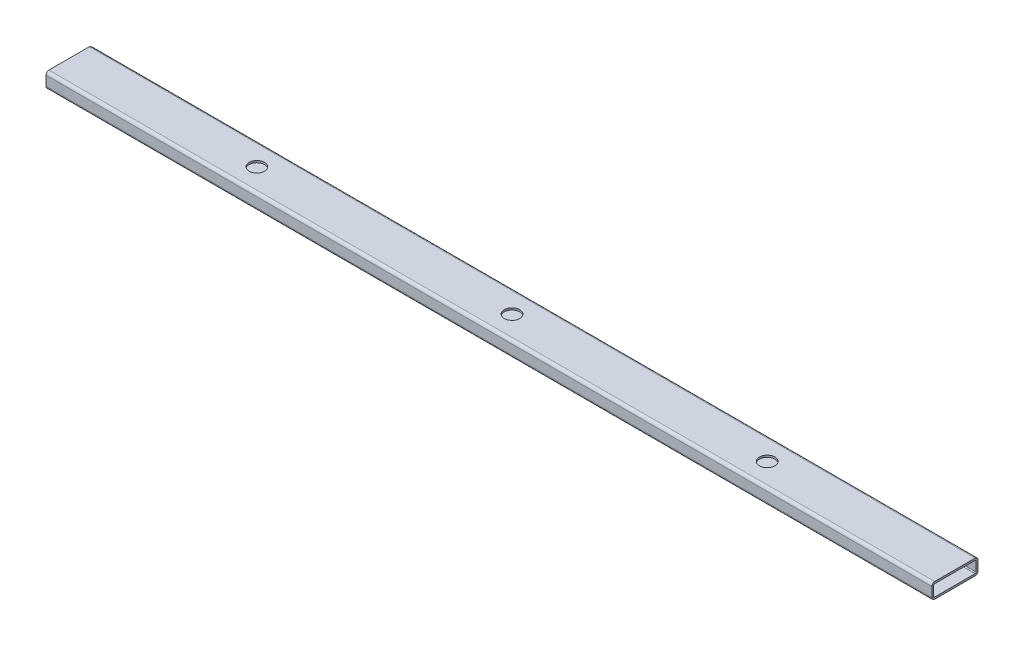
ISO-10303-21;
HEADER;
FILE_DESCRIPTION(('STEP AP214'),'2;1');
FILE_NAME('part.step','',(''),(''),'','','');
FILE_SCHEMA(('AUTOMOTIVE_DESIGN { 1 0 10303 214 1 1 1 1 }'));
ENDSEC;
DATA;
#1=APPLICATION_CONTEXT('core data for automotive mechanical design processes');
#2=APPLICATION_PROTOCOL_DEFINITION('international standard','automotive_design',2000,#1);
#3=PRODUCT_CONTEXT('',#1,'mechanical');
#4=PRODUCT('Part','Part','',(#3));
#5=PRODUCT_RELATED_PRODUCT_CATEGORY('part','',(#4));
#6=PRODUCT_DEFINITION_FORMATION('','',#4);
#7=PRODUCT_DEFINITION_CONTEXT('part definition',#1,'design');
#8=PRODUCT_DEFINITION('design','',#6,#7);
#9=PRODUCT_DEFINITION_SHAPE('','',#8);
#10=(LENGTH_UNIT() NAMED_UNIT(*) SI_UNIT(.MILLI.,.METRE.));
#11=(NAMED_UNIT(*) PLANE_ANGLE_UNIT() SI_UNIT($,.RADIAN.));
#12=(NAMED_UNIT(*) SI_UNIT($,.STERADIAN.) SOLID_ANGLE_UNIT());
#13=UNCERTAINTY_MEASURE_WITH_UNIT(LENGTH_MEASURE(1.E-05),#10,'distance_accuracy_value','');
#14=(GEOMETRIC_REPRESENTATION_CONTEXT(3) GLOBAL_UNCERTAINTY_ASSIGNED_CONTEXT((#13)) GLOBAL_UNIT_ASSIGNED_CONTEXT((#10,
#11,#12)) REPRESENTATION_CONTEXT('',''));
#15=CARTESIAN_POINT('',(0.,0.,0.));
#16=DIRECTION('',(0.,0.,1.));
#17=DIRECTION('',(1.,0.,0.));
#18=AXIS2_PLACEMENT_3D('',#15,#16,#17);
#19=CARTESIAN_POINT('',(420.6875,-0.00100000000002529,0.));
#20=DIRECTION('',(0.,1.,0.));
#21=DIRECTION('',(0.,0.,1.));
#22=AXIS2_PLACEMENT_3D('',#19,#20,#21);
#23=CYLINDRICAL_SURFACE('',#22,12.7);
#24=CARTESIAN_POINT('',(420.6875,22.225,0.));
#25=DIRECTION('',(0.,-1.,0.));
#26=DIRECTION('',(0.,0.,-1.));
#27=AXIS2_PLACEMENT_3D('',#24,#25,#26);
#28=CIRCLE('',#27,12.7);
#29=CARTESIAN_POINT('',(420.6875,22.225,-12.7));
#30=VERTEX_POINT('',#29);
#31=EDGE_CURVE('E43',#30,#30,#28,.F.);
#32=ORIENTED_EDGE('',*,*,#31,.F.);
#33=EDGE_LOOP('',(#32));
#34=FACE_BOUND('',#33,.T.);
#35=CARTESIAN_POINT('',(420.6875,25.4,0.));
#36=DIRECTION('',(0.,1.,0.));
#37=DIRECTION('',(0.,0.,1.));
#38=AXIS2_PLACEMENT_3D('',#35,#36,#37);
#39=CIRCLE('',#38,12.7);
#40=CARTESIAN_POINT('',(420.6875,25.4,12.7));
#41=VERTEX_POINT('',#40);
#42=EDGE_CURVE('E11',#41,#41,#39,.T.);
#43=ORIENTED_EDGE('',*,*,#42,.T.);
#44=EDGE_LOOP('',(#43));
#45=FACE_BOUND('',#44,.T.);
#46=ADVANCED_FACE('F36',(#34,#45),#23,.F.);
#47=CARTESIAN_POINT('',(730.25,20.6248,-33.3248));
#48=DIRECTION('',(1.,0.,0.));
#49=DIRECTION('',(0.,0.,-1.));
#50=AXIS2_PLACEMENT_3D('',#47,#48,#49);
#51=PLANE('',#50);
#52=CARTESIAN_POINT('',(730.25,20.6248,-33.3248));
#53=DIRECTION('',(1.,0.,0.));
#54=DIRECTION('',(0.,0.,-1.));
#55=AXIS2_PLACEMENT_3D('',#52,#53,#54);
#56=CIRCLE('',#55,4.77519999999999);
#57=CARTESIAN_POINT('',(730.25,20.6248,-38.1));
#58=VERTEX_POINT('',#57);
#59=CARTESIAN_POINT('',(730.25,25.4,-33.3248));
#60=VERTEX_POINT('',#59);
#61=EDGE_CURVE('E217',#58,#60,#56,.T.);
#62=ORIENTED_EDGE('',*,*,#61,.T.);
#63=DIRECTION('',(0.,0.,1.));
#64=VECTOR('',#63,1.);
#65=CARTESIAN_POINT('',(730.25,25.4,-33.3248));
#66=LINE('',#65,#64);
#67=CARTESIAN_POINT('',(730.25,25.4,33.3248));
#68=VERTEX_POINT('',#67);
#69=EDGE_CURVE('E220',#60,#68,#66,.T.);
#70=ORIENTED_EDGE('',*,*,#69,.T.);
#71=CARTESIAN_POINT('',(730.25,20.6248,33.3248));
#72=DIRECTION('',(1.,0.,0.));
#73=DIRECTION('',(0.,0.,1.));
#74=AXIS2_PLACEMENT_3D('',#71,#72,#73);
#75=CIRCLE('',#74,4.77519999999999);
#76=CARTESIAN_POINT('',(730.25,20.6248,38.1));
#77=VERTEX_POINT('',#76);
#78=EDGE_CURVE('E223',#68,#77,#75,.T.);
#79=ORIENTED_EDGE('',*,*,#78,.T.);
#80=DIRECTION('',(0.,-1.,0.));
#81=VECTOR('',#80,1.);
#82=CARTESIAN_POINT('',(730.25,20.6248,38.1));
#83=LINE('',#82,#81);
#84=CARTESIAN_POINT('',(730.25,4.77519999999999,38.1));
#85=VERTEX_POINT('',#84);
#86=EDGE_CURVE('E225',#77,#85,#83,.T.);
#87=ORIENTED_EDGE('',*,*,#86,.T.);
#88=CARTESIAN_POINT('',(730.25,4.77519999999999,33.3248));
#89=DIRECTION('',(1.,0.,0.));
#90=DIRECTION('',(0.,0.,1.));
#91=AXIS2_PLACEMENT_3D('',#88,#89,#90);
#92=CIRCLE('',#91,4.7752);
#93=CARTESIAN_POINT('',(730.25,0.,33.3248));
#94=VERTEX_POINT('',#93);
#95=EDGE_CURVE('E227',#85,#94,#92,.T.);
#96=ORIENTED_EDGE('',*,*,#95,.T.);
#97=DIRECTION('',(0.,0.,-1.));
#98=VECTOR('',#97,1.);
#99=CARTESIAN_POINT('',(730.25,0.,-33.3248));
#100=LINE('',#99,#98);
#101=CARTESIAN_POINT('',(730.25,0.,-33.3248));
#102=VERTEX_POINT('',#101);
#103=EDGE_CURVE('E229',#94,#102,#100,.T.);
#104=ORIENTED_EDGE('',*,*,#103,.T.);
#105=CARTESIAN_POINT('',(730.25,4.77520000000001,-33.3248));
#106=DIRECTION('',(1.,0.,0.));
#107=DIRECTION('',(0.,0.,1.));
#108=AXIS2_PLACEMENT_3D('',#105,#106,#107);
#109=CIRCLE('',#108,4.7752);
#110=CARTESIAN_POINT('',(730.25,4.77520000000001,-38.1));
#111=VERTEX_POINT('',#110);
#112=EDGE_CURVE('E231',#102,#111,#109,.T.);
#113=ORIENTED_EDGE('',*,*,#112,.T.);
#114=DIRECTION('',(0.,1.,0.));
#115=VECTOR('',#114,1.);
#116=CARTESIAN_POINT('',(730.25,20.6248,-38.1));
#117=LINE('',#116,#115);
#118=EDGE_CURVE('E233',#111,#58,#117,.T.);
#119=ORIENTED_EDGE('',*,*,#118,.T.);
#120=EDGE_LOOP('',(#62,#70,#79,#87,#96,#104,#113,#119));
#121=FACE_BOUND('',#120,.T.);
#122=DIRECTION('',(0.,0.,1.));
#123=VECTOR('',#122,1.);
#124=CARTESIAN_POINT('',(730.25,22.225,-33.3248));
#125=LINE('',#124,#123);
#126=CARTESIAN_POINT('',(730.25,22.225,-33.3248));
#127=VERTEX_POINT('',#126);
#128=CARTESIAN_POINT('',(730.25,22.225,33.3248));
#129=VERTEX_POINT('',#128);
#130=EDGE_CURVE('E156',#127,#129,#125,.T.);
#131=ORIENTED_EDGE('',*,*,#130,.F.);
#132=CARTESIAN_POINT('',(730.25,20.6248,-33.3248));
#133=DIRECTION('',(1.,0.,0.));
#134=DIRECTION('',(0.,0.,-1.));
#135=AXIS2_PLACEMENT_3D('',#132,#133,#134);
#136=CIRCLE('',#135,1.6002);
#137=CARTESIAN_POINT('',(730.25,20.6248,-34.925));
#138=VERTEX_POINT('',#137);
#139=EDGE_CURVE('E148',#138,#127,#136,.T.);
#140=ORIENTED_EDGE('',*,*,#139,.F.);
#141=DIRECTION('',(0.,1.,0.));
#142=VECTOR('',#141,1.);
#143=CARTESIAN_POINT('',(730.25,20.6248,-34.925));
#144=LINE('',#143,#142);
#145=CARTESIAN_POINT('',(730.25,4.77520000000001,-34.925));
#146=VERTEX_POINT('',#145);
#147=EDGE_CURVE('E184',#146,#138,#144,.T.);
#148=ORIENTED_EDGE('',*,*,#147,.F.);
#149=CARTESIAN_POINT('',(730.25,4.77520000000001,-33.3248));
#150=DIRECTION('',(1.,0.,0.));
#151=DIRECTION('',(0.,0.,1.));
#152=AXIS2_PLACEMENT_3D('',#149,#150,#151);
#153=CIRCLE('',#152,1.6002);
#154=CARTESIAN_POINT('',(730.25,3.17500000000001,-33.3248));
#155=VERTEX_POINT('',#154);
#156=EDGE_CURVE('E182',#155,#146,#153,.T.);
#157=ORIENTED_EDGE('',*,*,#156,.F.);
#158=DIRECTION('',(0.,0.,-1.));
#159=VECTOR('',#158,1.);
#160=CARTESIAN_POINT('',(730.25,3.17500000000001,-33.3248));
#161=LINE('',#160,#159);
#162=CARTESIAN_POINT('',(730.25,3.17499999999999,33.3248));
#163=VERTEX_POINT('',#162);
#164=EDGE_CURVE('E180',#163,#155,#161,.T.);
#165=ORIENTED_EDGE('',*,*,#164,.F.);
#166=CARTESIAN_POINT('',(730.25,4.77519999999999,33.3248));
#167=DIRECTION('',(1.,0.,0.));
#168=DIRECTION('',(0.,0.,1.));
#169=AXIS2_PLACEMENT_3D('',#166,#167,#168);
#170=CIRCLE('',#169,1.60020000000001);
#171=CARTESIAN_POINT('',(730.25,4.77519999999999,34.925));
#172=VERTEX_POINT('',#171);
#173=EDGE_CURVE('E178',#172,#163,#170,.T.);
#174=ORIENTED_EDGE('',*,*,#173,.F.);
#175=DIRECTION('',(0.,-1.,0.));
#176=VECTOR('',#175,1.);
#177=CARTESIAN_POINT('',(730.25,20.6248,34.925));
#178=LINE('',#177,#176);
#179=CARTESIAN_POINT('',(730.25,20.6248,34.925));
#180=VERTEX_POINT('',#179);
#181=EDGE_CURVE('E173',#180,#172,#178,.T.);
#182=ORIENTED_EDGE('',*,*,#181,.F.);
#183=CARTESIAN_POINT('',(730.25,20.6248,33.3248));
#184=DIRECTION('',(1.,0.,0.));
#185=DIRECTION('',(0.,0.,1.));
#186=AXIS2_PLACEMENT_3D('',#183,#184,#185);
#187=CIRCLE('',#186,1.60020000000001);
#188=EDGE_CURVE('E171',#129,#180,#187,.T.);
#189=ORIENTED_EDGE('',*,*,#188,.F.);
#190=EDGE_LOOP('',(#131,#140,#148,#157,#165,#174,#182,#189));
#191=FACE_BOUND('',#190,.T.);
#192=ADVANCED_FACE('F169',(#121,#191),#51,.T.);
#193=CARTESIAN_POINT('',(-730.25,20.6248,-33.3248));
#194=DIRECTION('',(1.,0.,0.));
#195=DIRECTION('',(0.,0.,-1.));
#196=AXIS2_PLACEMENT_3D('',#193,#194,#195);
#197=PLANE('',#196);
#198=CARTESIAN_POINT('',(-730.25,20.6248,-33.3248));
#199=DIRECTION('',(1.,0.,0.));
#200=DIRECTION('',(0.,0.,-1.));
#201=AXIS2_PLACEMENT_3D('',#198,#199,#200);
#202=CIRCLE('',#201,4.77519999999999);
#203=CARTESIAN_POINT('',(-730.25,20.6248,-38.1));
#204=VERTEX_POINT('',#203);
#205=CARTESIAN_POINT('',(-730.25,25.4,-33.3248));
#206=VERTEX_POINT('',#205);
#207=EDGE_CURVE('E165',#204,#206,#202,.T.);
#208=ORIENTED_EDGE('',*,*,#207,.F.);
#209=DIRECTION('',(0.,1.,0.));
#210=VECTOR('',#209,1.);
#211=CARTESIAN_POINT('',(-730.25,20.6248,-38.1));
#212=LINE('',#211,#210);
#213=CARTESIAN_POINT('',(-730.25,4.77520000000001,-38.1));
#214=VERTEX_POINT('',#213);
#215=EDGE_CURVE('E221',#214,#204,#212,.T.);
#216=ORIENTED_EDGE('',*,*,#215,.F.);
#217=CARTESIAN_POINT('',(-730.25,4.77520000000001,-33.3248));
#218=DIRECTION('',(1.,0.,0.));
#219=DIRECTION('',(0.,0.,1.));
#220=AXIS2_PLACEMENT_3D('',#217,#218,#219);
#221=CIRCLE('',#220,4.7752);
#222=CARTESIAN_POINT('',(-730.25,0.,-33.3248));
#223=VERTEX_POINT('',#222);
#224=EDGE_CURVE('E248',#223,#214,#221,.T.);
#225=ORIENTED_EDGE('',*,*,#224,.F.);
#226=DIRECTION('',(0.,0.,-1.));
#227=VECTOR('',#226,1.);
#228=CARTESIAN_POINT('',(-730.25,0.,-33.3248));
#229=LINE('',#228,#227);
#230=CARTESIAN_POINT('',(-730.25,0.,33.3248));
#231=VERTEX_POINT('',#230);
#232=EDGE_CURVE('E246',#231,#223,#229,.T.);
#233=ORIENTED_EDGE('',*,*,#232,.F.);
#234=CARTESIAN_POINT('',(-730.25,4.77519999999999,33.3248));
#235=DIRECTION('',(1.,0.,0.));
#236=DIRECTION('',(0.,0.,1.));
#237=AXIS2_PLACEMENT_3D('',#234,#235,#236);
#238=CIRCLE('',#237,4.7752);
#239=CARTESIAN_POINT('',(-730.25,4.77519999999999,38.1));
#240=VERTEX_POINT('',#239);
#241=EDGE_CURVE('E244',#240,#231,#238,.T.);
#242=ORIENTED_EDGE('',*,*,#241,.F.);
#243=DIRECTION('',(0.,-1.,0.));
#244=VECTOR('',#243,1.);
#245=CARTESIAN_POINT('',(-730.25,20.6248,38.1));
#246=LINE('',#245,#244);
#247=CARTESIAN_POINT('',(-730.25,20.6248,38.1));
#248=VERTEX_POINT('',#247);
#249=EDGE_CURVE('E242',#248,#240,#246,.T.);
#250=ORIENTED_EDGE('',*,*,#249,.F.);
#251=CARTESIAN_POINT('',(-730.25,20.6248,33.3248));
#252=DIRECTION('',(1.,0.,0.));
#253=DIRECTION('',(0.,0.,1.));
#254=AXIS2_PLACEMENT_3D('',#251,#252,#253);
#255=CIRCLE('',#254,4.77519999999999);
#256=CARTESIAN_POINT('',(-730.25,25.4,33.3248));
#257=VERTEX_POINT('',#256);
#258=EDGE_CURVE('E240',#257,#248,#255,.T.);
#259=ORIENTED_EDGE('',*,*,#258,.F.);
#260=DIRECTION('',(0.,0.,1.));
#261=VECTOR('',#260,1.);
#262=CARTESIAN_POINT('',(-730.25,25.4,-33.3248));
#263=LINE('',#262,#261);
#264=EDGE_CURVE('E238',#206,#257,#263,.T.);
#265=ORIENTED_EDGE('',*,*,#264,.F.);
#266=EDGE_LOOP('',(#208,#216,#225,#233,#242,#250,#259,#265));
#267=FACE_BOUND('',#266,.T.);
#268=CARTESIAN_POINT('',(-730.25,20.6248,-33.3248));
#269=DIRECTION('',(1.,0.,0.));
#270=DIRECTION('',(0.,0.,-1.));
#271=AXIS2_PLACEMENT_3D('',#268,#269,#270);
#272=CIRCLE('',#271,1.6002);
#273=CARTESIAN_POINT('',(-730.25,20.6248,-34.925));
#274=VERTEX_POINT('',#273);
#275=CARTESIAN_POINT('',(-730.25,22.225,-33.3248));
#276=VERTEX_POINT('',#275);
#277=EDGE_CURVE('E58',#274,#276,#272,.T.);
#278=ORIENTED_EDGE('',*,*,#277,.T.);
#279=DIRECTION('',(0.,0.,1.));
#280=VECTOR('',#279,1.);
#281=CARTESIAN_POINT('',(-730.25,22.225,-33.3248));
#282=LINE('',#281,#280);
#283=CARTESIAN_POINT('',(-730.25,22.225,33.3248));
#284=VERTEX_POINT('',#283);
#285=EDGE_CURVE('E164',#276,#284,#282,.T.);
#286=ORIENTED_EDGE('',*,*,#285,.T.);
#287=CARTESIAN_POINT('',(-730.25,20.6248,33.3248));
#288=DIRECTION('',(1.,0.,0.));
#289=DIRECTION('',(0.,0.,1.));
#290=AXIS2_PLACEMENT_3D('',#287,#288,#289);
#291=CIRCLE('',#290,1.60020000000001);
#292=CARTESIAN_POINT('',(-730.25,20.6248,34.925));
#293=VERTEX_POINT('',#292);
#294=EDGE_CURVE('E189',#284,#293,#291,.T.);
#295=ORIENTED_EDGE('',*,*,#294,.T.);
#296=DIRECTION('',(0.,-1.,0.));
#297=VECTOR('',#296,1.);
#298=CARTESIAN_POINT('',(-730.25,20.6248,34.925));
#299=LINE('',#298,#297);
#300=CARTESIAN_POINT('',(-730.25,4.77519999999999,34.925));
#301=VERTEX_POINT('',#300);
#302=EDGE_CURVE('E192',#293,#301,#299,.T.);
#303=ORIENTED_EDGE('',*,*,#302,.T.);
#304=CARTESIAN_POINT('',(-730.25,4.77519999999999,33.3248));
#305=DIRECTION('',(1.,0.,0.));
#306=DIRECTION('',(0.,0.,1.));
#307=AXIS2_PLACEMENT_3D('',#304,#305,#306);
#308=CIRCLE('',#307,1.60020000000001);
#309=CARTESIAN_POINT('',(-730.25,3.17499999999999,33.3248));
#310=VERTEX_POINT('',#309);
#311=EDGE_CURVE('E195',#301,#310,#308,.T.);
#312=ORIENTED_EDGE('',*,*,#311,.T.);
#313=DIRECTION('',(0.,0.,-1.));
#314=VECTOR('',#313,1.);
#315=CARTESIAN_POINT('',(-730.25,3.17500000000001,-33.3248));
#316=LINE('',#315,#314);
#317=CARTESIAN_POINT('',(-730.25,3.17500000000001,-33.3248));
#318=VERTEX_POINT('',#317);
#319=EDGE_CURVE('E198',#310,#318,#316,.T.);
#320=ORIENTED_EDGE('',*,*,#319,.T.);
#321=CARTESIAN_POINT('',(-730.25,4.77520000000001,-33.3248));
#322=DIRECTION('',(1.,0.,0.));
#323=DIRECTION('',(0.,0.,1.));
#324=AXIS2_PLACEMENT_3D('',#321,#322,#323);
#325=CIRCLE('',#324,1.6002);
#326=CARTESIAN_POINT('',(-730.25,4.77520000000001,-34.925));
#327=VERTEX_POINT('',#326);
#328=EDGE_CURVE('E201',#318,#327,#325,.T.);
#329=ORIENTED_EDGE('',*,*,#328,.T.);
#330=DIRECTION('',(0.,1.,0.));
#331=VECTOR('',#330,1.);
#332=CARTESIAN_POINT('',(-730.25,20.6248,-34.925));
#333=LINE('',#332,#331);
#334=EDGE_CURVE('E157',#327,#274,#333,.T.);
#335=ORIENTED_EDGE('',*,*,#334,.T.);
#336=EDGE_LOOP('',(#278,#286,#295,#303,#312,#320,#329,#335));
#337=FACE_BOUND('',#336,.T.);
#338=ADVANCED_FACE('F293',(#267,#337),#197,.F.);
#339=CARTESIAN_POINT('',(730.25,20.6248,-33.3248));
#340=DIRECTION('',(-1.,0.,0.));
#341=DIRECTION('',(0.,0.,1.));
#342=AXIS2_PLACEMENT_3D('',#339,#340,#341);
#343=CYLINDRICAL_SURFACE('',#342,4.77519999999999);
#344=ORIENTED_EDGE('',*,*,#207,.T.);
#345=DIRECTION('',(-1.,0.,0.));
#346=VECTOR('',#345,1.);
#347=CARTESIAN_POINT('',(730.25,25.4,-33.3248));
#348=LINE('',#347,#346);
#349=EDGE_CURVE('E271',#60,#206,#348,.T.);
#350=ORIENTED_EDGE('',*,*,#349,.F.);
#351=ORIENTED_EDGE('',*,*,#61,.F.);
#352=DIRECTION('',(-1.,0.,0.));
#353=VECTOR('',#352,1.);
#354=CARTESIAN_POINT('',(730.25,20.6248,-38.1));
#355=LINE('',#354,#353);
#356=EDGE_CURVE('E235',#58,#204,#355,.T.);
#357=ORIENTED_EDGE('',*,*,#356,.T.);
#358=EDGE_LOOP('',(#344,#350,#351,#357));
#359=FACE_BOUND('',#358,.T.);
#360=ADVANCED_FACE('F283',(#359),#343,.T.);
#361=CARTESIAN_POINT('',(730.25,25.4,-33.3248));
#362=DIRECTION('',(0.,-1.,0.));
#363=DIRECTION('',(0.,0.,-1.));
#364=AXIS2_PLACEMENT_3D('',#361,#362,#363);
#365=PLANE('',#364);
#366=CARTESIAN_POINT('',(0.,25.4,0.));
#367=DIRECTION('',(0.,1.,0.));
#368=DIRECTION('',(0.,0.,1.));
#369=AXIS2_PLACEMENT_3D('',#366,#367,#368);
#370=CIRCLE('',#369,12.7);
#371=CARTESIAN_POINT('',(0.,25.4,12.7));
#372=VERTEX_POINT('',#371);
#373=EDGE_CURVE('E365',#372,#372,#370,.T.);
#374=ORIENTED_EDGE('',*,*,#373,.F.);
#375=EDGE_LOOP('',(#374));
#376=FACE_BOUND('',#375,.T.);
#377=CARTESIAN_POINT('',(-420.6875,25.4,0.));
#378=DIRECTION('',(0.,1.,0.));
#379=DIRECTION('',(0.,0.,1.));
#380=AXIS2_PLACEMENT_3D('',#377,#378,#379);
#381=CIRCLE('',#380,12.7);
#382=CARTESIAN_POINT('',(-420.6875,25.4,12.7));
#383=VERTEX_POINT('',#382);
#384=EDGE_CURVE('E187',#383,#383,#381,.T.);
#385=ORIENTED_EDGE('',*,*,#384,.F.);
#386=EDGE_LOOP('',(#385));
#387=FACE_BOUND('',#386,.T.);
#388=ORIENTED_EDGE('',*,*,#264,.T.);
#389=DIRECTION('',(-1.,0.,0.));
#390=VECTOR('',#389,1.);
#391=CARTESIAN_POINT('',(730.25,25.4,33.3248));
#392=LINE('',#391,#390);
#393=EDGE_CURVE('E268',#68,#257,#392,.T.);
#394=ORIENTED_EDGE('',*,*,#393,.F.);
#395=ORIENTED_EDGE('',*,*,#69,.F.);
#396=ORIENTED_EDGE('',*,*,#349,.T.);
#397=EDGE_LOOP('',(#388,#394,#395,#396));
#398=FACE_BOUND('',#397,.T.);
#399=ORIENTED_EDGE('',*,*,#42,.F.);
#400=EDGE_LOOP('',(#399));
#401=FACE_BOUND('',#400,.T.);
#402=ADVANCED_FACE('F280',(#376,#387,#398,#401),#365,.F.);
#403=CARTESIAN_POINT('',(730.25,20.6248,33.3248));
#404=DIRECTION('',(-1.,0.,0.));
#405=DIRECTION('',(0.,0.,1.));
#406=AXIS2_PLACEMENT_3D('',#403,#404,#405);
#407=CYLINDRICAL_SURFACE('',#406,4.77519999999999);
#408=ORIENTED_EDGE('',*,*,#258,.T.);
#409=DIRECTION('',(-1.,0.,0.));
#410=VECTOR('',#409,1.);
#411=CARTESIAN_POINT('',(730.25,20.6248,38.1));
#412=LINE('',#411,#410);
#413=EDGE_CURVE('E265',#77,#248,#412,.T.);
#414=ORIENTED_EDGE('',*,*,#413,.F.);
#415=ORIENTED_EDGE('',*,*,#78,.F.);
#416=ORIENTED_EDGE('',*,*,#393,.T.);
#417=EDGE_LOOP('',(#408,#414,#415,#416));
#418=FACE_BOUND('',#417,.T.);
#419=ADVANCED_FACE('F282',(#418),#407,.T.);
#420=CARTESIAN_POINT('',(730.25,20.6248,38.1));
#421=DIRECTION('',(0.,0.,-1.));
#422=DIRECTION('',(0.,1.,0.));
#423=AXIS2_PLACEMENT_3D('',#420,#421,#422);
#424=PLANE('',#423);
#425=ORIENTED_EDGE('',*,*,#249,.T.);
#426=DIRECTION('',(-1.,0.,0.));
#427=VECTOR('',#426,1.);
#428=CARTESIAN_POINT('',(730.25,4.77519999999999,38.1));
#429=LINE('',#428,#427);
#430=EDGE_CURVE('E262',#85,#240,#429,.T.);
#431=ORIENTED_EDGE('',*,*,#430,.F.);
#432=ORIENTED_EDGE('',*,*,#86,.F.);
#433=ORIENTED_EDGE('',*,*,#413,.T.);
#434=EDGE_LOOP('',(#425,#431,#432,#433));
#435=FACE_BOUND('',#434,.T.);
#436=ADVANCED_FACE('F290',(#435),#424,.F.);
#437=CARTESIAN_POINT('',(730.25,4.77519999999999,33.3248));
#438=DIRECTION('',(-1.,0.,0.));
#439=DIRECTION('',(0.,0.,1.));
#440=AXIS2_PLACEMENT_3D('',#437,#438,#439);
#441=CYLINDRICAL_SURFACE('',#440,4.7752);
#442=ORIENTED_EDGE('',*,*,#241,.T.);
#443=DIRECTION('',(-1.,0.,0.));
#444=VECTOR('',#443,1.);
#445=CARTESIAN_POINT('',(730.25,0.,33.3248));
#446=LINE('',#445,#444);
#447=EDGE_CURVE('E259',#94,#231,#446,.T.);
#448=ORIENTED_EDGE('',*,*,#447,.F.);
#449=ORIENTED_EDGE('',*,*,#95,.F.);
#450=ORIENTED_EDGE('',*,*,#430,.T.);
#451=EDGE_LOOP('',(#442,#448,#449,#450));
#452=FACE_BOUND('',#451,.T.);
#453=ADVANCED_FACE('F300',(#452),#441,.T.);
#454=CARTESIAN_POINT('',(730.25,0.,-33.3248));
#455=DIRECTION('',(0.,1.,0.));
#456=DIRECTION('',(0.,0.,1.));
#457=AXIS2_PLACEMENT_3D('',#454,#455,#456);
#458=PLANE('',#457);
#459=ORIENTED_EDGE('',*,*,#232,.T.);
#460=DIRECTION('',(-1.,0.,0.));
#461=VECTOR('',#460,1.);
#462=CARTESIAN_POINT('',(730.25,0.,-33.3248));
#463=LINE('',#462,#461);
#464=EDGE_CURVE('E256',#102,#223,#463,.T.);
#465=ORIENTED_EDGE('',*,*,#464,.F.);
#466=ORIENTED_EDGE('',*,*,#103,.F.);
#467=ORIENTED_EDGE('',*,*,#447,.T.);
#468=EDGE_LOOP('',(#459,#465,#466,#467));
#469=FACE_BOUND('',#468,.T.);
#470=ADVANCED_FACE('F304',(#469),#458,.F.);
#471=CARTESIAN_POINT('',(730.25,4.77520000000001,-33.3248));
#472=DIRECTION('',(-1.,0.,0.));
#473=DIRECTION('',(0.,0.,1.));
#474=AXIS2_PLACEMENT_3D('',#471,#472,#473);
#475=CYLINDRICAL_SURFACE('',#474,4.7752);
#476=ORIENTED_EDGE('',*,*,#224,.T.);
#477=DIRECTION('',(-1.,0.,0.));
#478=VECTOR('',#477,1.);
#479=CARTESIAN_POINT('',(730.25,4.77520000000001,-38.1));
#480=LINE('',#479,#478);
#481=EDGE_CURVE('E253',#111,#214,#480,.T.);
#482=ORIENTED_EDGE('',*,*,#481,.F.);
#483=ORIENTED_EDGE('',*,*,#112,.F.);
#484=ORIENTED_EDGE('',*,*,#464,.T.);
#485=EDGE_LOOP('',(#476,#482,#483,#484));
#486=FACE_BOUND('',#485,.T.);
#487=ADVANCED_FACE('F308',(#486),#475,.T.);
#488=CARTESIAN_POINT('',(730.25,20.6248,-38.1));
#489=DIRECTION('',(0.,0.,1.));
#490=DIRECTION('',(0.,-1.,0.));
#491=AXIS2_PLACEMENT_3D('',#488,#489,#490);
#492=PLANE('',#491);
#493=ORIENTED_EDGE('',*,*,#215,.T.);
#494=ORIENTED_EDGE('',*,*,#356,.F.);
#495=ORIENTED_EDGE('',*,*,#118,.F.);
#496=ORIENTED_EDGE('',*,*,#481,.T.);
#497=EDGE_LOOP('',(#493,#494,#495,#496));
#498=FACE_BOUND('',#497,.T.);
#499=ADVANCED_FACE('F312',(#498),#492,.F.);
#500=CARTESIAN_POINT('',(730.25,20.6248,-33.3248));
#501=DIRECTION('',(-1.,0.,0.));
#502=DIRECTION('',(0.,0.,1.));
#503=AXIS2_PLACEMENT_3D('',#500,#501,#502);
#504=CYLINDRICAL_SURFACE('',#503,1.6002);
#505=ORIENTED_EDGE('',*,*,#277,.F.);
#506=DIRECTION('',(-1.,0.,0.));
#507=VECTOR('',#506,1.);
#508=CARTESIAN_POINT('',(730.25,20.6248,-34.925));
#509=LINE('',#508,#507);
#510=EDGE_CURVE('E152',#138,#274,#509,.T.);
#511=ORIENTED_EDGE('',*,*,#510,.F.);
#512=ORIENTED_EDGE('',*,*,#139,.T.);
#513=DIRECTION('',(-1.,0.,0.));
#514=VECTOR('',#513,1.);
#515=CARTESIAN_POINT('',(730.25,22.225,-33.3248));
#516=LINE('',#515,#514);
#517=EDGE_CURVE('E151',#127,#276,#516,.T.);
#518=ORIENTED_EDGE('',*,*,#517,.T.);
#519=EDGE_LOOP('',(#505,#511,#512,#518));
#520=FACE_BOUND('',#519,.T.);
#521=ADVANCED_FACE('F150',(#520),#504,.F.);
#522=CARTESIAN_POINT('',(730.25,22.225,-33.3248));
#523=DIRECTION('',(0.,-1.,0.));
#524=DIRECTION('',(0.,0.,-1.));
#525=AXIS2_PLACEMENT_3D('',#522,#523,#524);
#526=PLANE('',#525);
#527=CARTESIAN_POINT('',(0.,22.225,0.));
#528=DIRECTION('',(0.,-1.,0.));
#529=DIRECTION('',(0.,0.,-1.));
#530=AXIS2_PLACEMENT_3D('',#527,#528,#529);
#531=CIRCLE('',#530,12.7);
#532=CARTESIAN_POINT('',(0.,22.225,-12.7));
#533=VERTEX_POINT('',#532);
#534=EDGE_CURVE('E363',#533,#533,#531,.F.);
#535=ORIENTED_EDGE('',*,*,#534,.T.);
#536=EDGE_LOOP('',(#535));
#537=FACE_BOUND('',#536,.T.);
#538=CARTESIAN_POINT('',(-420.6875,22.225,0.));
#539=DIRECTION('',(0.,-1.,0.));
#540=DIRECTION('',(0.,0.,-1.));
#541=AXIS2_PLACEMENT_3D('',#538,#539,#540);
#542=CIRCLE('',#541,12.7);
#543=CARTESIAN_POINT('',(-420.6875,22.225,-12.7));
#544=VERTEX_POINT('',#543);
#545=EDGE_CURVE('E366',#544,#544,#542,.F.);
#546=ORIENTED_EDGE('',*,*,#545,.T.);
#547=EDGE_LOOP('',(#546));
#548=FACE_BOUND('',#547,.T.);
#549=ORIENTED_EDGE('',*,*,#285,.F.);
#550=ORIENTED_EDGE('',*,*,#517,.F.);
#551=ORIENTED_EDGE('',*,*,#130,.T.);
#552=DIRECTION('',(-1.,0.,0.));
#553=VECTOR('',#552,1.);
#554=CARTESIAN_POINT('',(730.25,22.225,33.3248));
#555=LINE('',#554,#553);
#556=EDGE_CURVE('E166',#129,#284,#555,.T.);
#557=ORIENTED_EDGE('',*,*,#556,.T.);
#558=EDGE_LOOP('',(#549,#550,#551,#557));
#559=FACE_BOUND('',#558,.T.);
#560=ORIENTED_EDGE('',*,*,#31,.T.);
#561=EDGE_LOOP('',(#560));
#562=FACE_BOUND('',#561,.T.);
#563=ADVANCED_FACE('F160',(#537,#548,#559,#562),#526,.T.);
#564=CARTESIAN_POINT('',(730.25,20.6248,33.3248));
#565=DIRECTION('',(-1.,0.,0.));
#566=DIRECTION('',(0.,0.,1.));
#567=AXIS2_PLACEMENT_3D('',#564,#565,#566);
#568=CYLINDRICAL_SURFACE('',#567,1.60020000000001);
#569=ORIENTED_EDGE('',*,*,#294,.F.);
#570=ORIENTED_EDGE('',*,*,#556,.F.);
#571=ORIENTED_EDGE('',*,*,#188,.T.);
#572=DIRECTION('',(-1.,0.,0.));
#573=VECTOR('',#572,1.);
#574=CARTESIAN_POINT('',(730.25,20.6248,34.925));
#575=LINE('',#574,#573);
#576=EDGE_CURVE('E214',#180,#293,#575,.T.);
#577=ORIENTED_EDGE('',*,*,#576,.T.);
#578=EDGE_LOOP('',(#569,#570,#571,#577));
#579=FACE_BOUND('',#578,.T.);
#580=ADVANCED_FACE('F327',(#579),#568,.F.);
#581=CARTESIAN_POINT('',(730.25,20.6248,34.925));
#582=DIRECTION('',(0.,0.,-1.));
#583=DIRECTION('',(-1.,0.,0.));
#584=AXIS2_PLACEMENT_3D('',#581,#582,#583);
#585=PLANE('',#584);
#586=ORIENTED_EDGE('',*,*,#302,.F.);
#587=ORIENTED_EDGE('',*,*,#576,.F.);
#588=ORIENTED_EDGE('',*,*,#181,.T.);
#589=DIRECTION('',(-1.,0.,0.));
#590=VECTOR('',#589,1.);
#591=CARTESIAN_POINT('',(730.25,4.77519999999999,34.925));
#592=LINE('',#591,#590);
#593=EDGE_CURVE('E212',#172,#301,#592,.T.);
#594=ORIENTED_EDGE('',*,*,#593,.T.);
#595=EDGE_LOOP('',(#586,#587,#588,#594));
#596=FACE_BOUND('',#595,.T.);
#597=ADVANCED_FACE('F331',(#596),#585,.T.);
#598=CARTESIAN_POINT('',(730.25,4.77519999999999,33.3248));
#599=DIRECTION('',(-1.,0.,0.));
#600=DIRECTION('',(0.,0.,1.));
#601=AXIS2_PLACEMENT_3D('',#598,#599,#600);
#602=CYLINDRICAL_SURFACE('',#601,1.60020000000001);
#603=ORIENTED_EDGE('',*,*,#311,.F.);
#604=ORIENTED_EDGE('',*,*,#593,.F.);
#605=ORIENTED_EDGE('',*,*,#173,.T.);
#606=DIRECTION('',(-1.,0.,0.));
#607=VECTOR('',#606,1.);
#608=CARTESIAN_POINT('',(730.25,3.17499999999999,33.3248));
#609=LINE('',#608,#607);
#610=EDGE_CURVE('E210',#163,#310,#609,.T.);
#611=ORIENTED_EDGE('',*,*,#610,.T.);
#612=EDGE_LOOP('',(#603,#604,#605,#611));
#613=FACE_BOUND('',#612,.T.);
#614=ADVANCED_FACE('F335',(#613),#602,.F.);
#615=CARTESIAN_POINT('',(730.25,3.17500000000001,-33.3248));
#616=DIRECTION('',(0.,1.,0.));
#617=DIRECTION('',(0.,0.,1.));
#618=AXIS2_PLACEMENT_3D('',#615,#616,#617);
#619=PLANE('',#618);
#620=ORIENTED_EDGE('',*,*,#319,.F.);
#621=ORIENTED_EDGE('',*,*,#610,.F.);
#622=ORIENTED_EDGE('',*,*,#164,.T.);
#623=DIRECTION('',(-1.,0.,0.));
#624=VECTOR('',#623,1.);
#625=CARTESIAN_POINT('',(730.25,3.17500000000001,-33.3248));
#626=LINE('',#625,#624);
#627=EDGE_CURVE('E208',#155,#318,#626,.T.);
#628=ORIENTED_EDGE('',*,*,#627,.T.);
#629=EDGE_LOOP('',(#620,#621,#622,#628));
#630=FACE_BOUND('',#629,.T.);
#631=ADVANCED_FACE('F339',(#630),#619,.T.);
#632=CARTESIAN_POINT('',(730.25,4.77520000000001,-33.3248));
#633=DIRECTION('',(-1.,0.,0.));
#634=DIRECTION('',(0.,0.,1.));
#635=AXIS2_PLACEMENT_3D('',#632,#633,#634);
#636=CYLINDRICAL_SURFACE('',#635,1.6002);
#637=ORIENTED_EDGE('',*,*,#328,.F.);
#638=ORIENTED_EDGE('',*,*,#627,.F.);
#639=ORIENTED_EDGE('',*,*,#156,.T.);
#640=DIRECTION('',(-1.,0.,0.));
#641=VECTOR('',#640,1.);
#642=CARTESIAN_POINT('',(730.25,4.77520000000001,-34.925));
#643=LINE('',#642,#641);
#644=EDGE_CURVE('E50',#146,#327,#643,.T.);
#645=ORIENTED_EDGE('',*,*,#644,.T.);
#646=EDGE_LOOP('',(#637,#638,#639,#645));
#647=FACE_BOUND('',#646,.T.);
#648=ADVANCED_FACE('F343',(#647),#636,.F.);
#649=CARTESIAN_POINT('',(730.25,20.6248,-34.925));
#650=DIRECTION('',(0.,0.,1.));
#651=DIRECTION('',(0.,-1.,0.));
#652=AXIS2_PLACEMENT_3D('',#649,#650,#651);
#653=PLANE('',#652);
#654=ORIENTED_EDGE('',*,*,#334,.F.);
#655=ORIENTED_EDGE('',*,*,#644,.F.);
#656=ORIENTED_EDGE('',*,*,#147,.T.);
#657=ORIENTED_EDGE('',*,*,#510,.T.);
#658=EDGE_LOOP('',(#654,#655,#656,#657));
#659=FACE_BOUND('',#658,.T.);
#660=ADVANCED_FACE('F347',(#659),#653,.T.);
#661=CARTESIAN_POINT('',(-420.6875,-0.00100000000002529,0.));
#662=DIRECTION('',(0.,1.,0.));
#663=DIRECTION('',(0.,0.,1.));
#664=AXIS2_PLACEMENT_3D('',#661,#662,#663);
#665=CYLINDRICAL_SURFACE('',#664,12.7);
#666=ORIENTED_EDGE('',*,*,#545,.F.);
#667=EDGE_LOOP('',(#666));
#668=FACE_BOUND('',#667,.T.);
#669=ORIENTED_EDGE('',*,*,#384,.T.);
#670=EDGE_LOOP('',(#669));
#671=FACE_BOUND('',#670,.T.);
#672=ADVANCED_FACE('F351',(#668,#671),#665,.F.);
#673=CARTESIAN_POINT('',(0.,-0.00100000000002529,0.));
#674=DIRECTION('',(0.,1.,0.));
#675=DIRECTION('',(0.,0.,1.));
#676=AXIS2_PLACEMENT_3D('',#673,#674,#675);
#677=CYLINDRICAL_SURFACE('',#676,12.7);
#678=ORIENTED_EDGE('',*,*,#534,.F.);
#679=EDGE_LOOP('',(#678));
#680=FACE_BOUND('',#679,.T.);
#681=ORIENTED_EDGE('',*,*,#373,.T.);
#682=EDGE_LOOP('',(#681));
#683=FACE_BOUND('',#682,.T.);
#684=ADVANCED_FACE('F354',(#680,#683),#677,.F.);
#685=CLOSED_SHELL('',(#46,#192,#338,#360,#402,#419,#436,#453,#470,#487,#499,#521,#563,#580,#597,
#614,#631,#648,#660,#672,#684));
#686=MANIFOLD_SOLID_BREP('B2',#685);
#687=ADVANCED_BREP_SHAPE_REPRESENTATION('',(#18,#686),#14);
#688=SHAPE_DEFINITION_REPRESENTATION(#9,#687);
ENDSEC;
END-ISO-10303-21;
